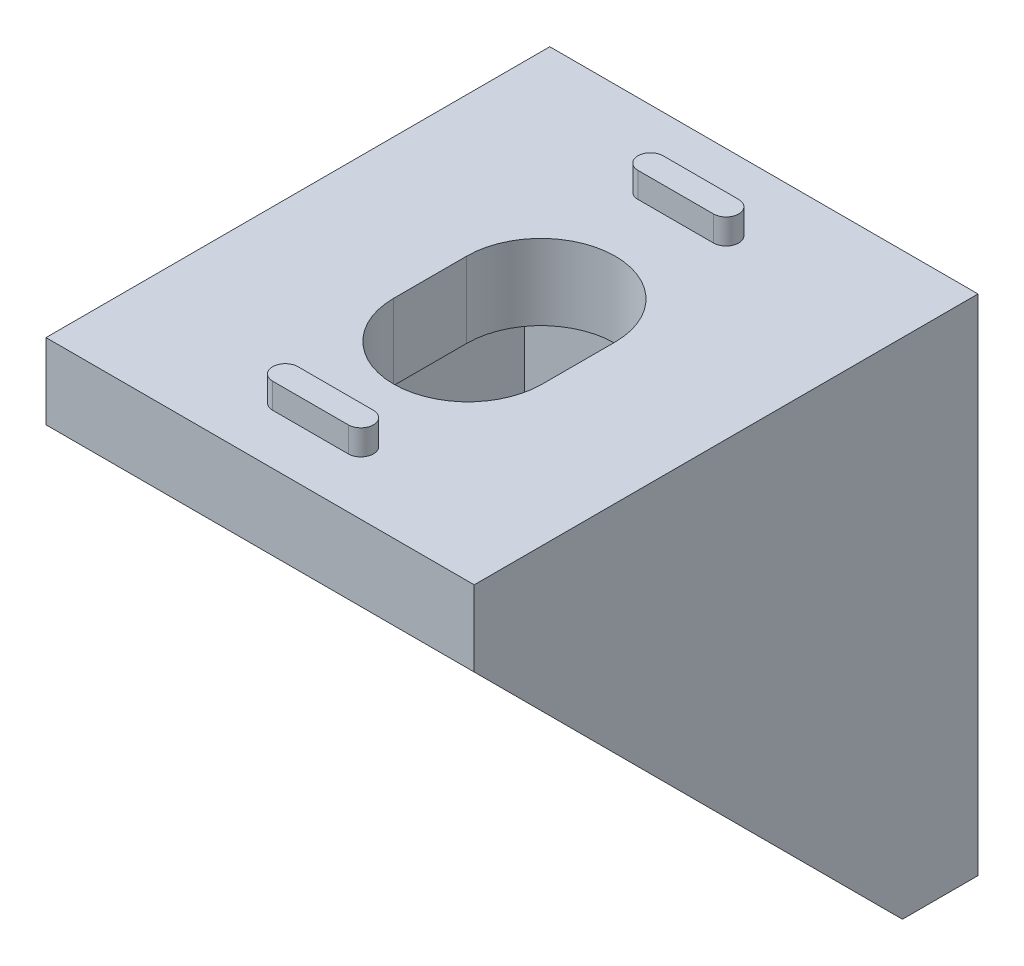
ISO-10303-21;
HEADER;
FILE_DESCRIPTION(('STEP AP214'),'2;1');
FILE_NAME('part.step','',(''),(''),'','','');
FILE_SCHEMA(('AUTOMOTIVE_DESIGN { 1 0 10303 214 1 1 1 1 }'));
ENDSEC;
DATA;
#1=APPLICATION_CONTEXT('core data for automotive mechanical design processes');
#2=APPLICATION_PROTOCOL_DEFINITION('international standard','automotive_design',2000,#1);
#3=PRODUCT_CONTEXT('',#1,'mechanical');
#4=PRODUCT('Part','Part','',(#3));
#5=PRODUCT_RELATED_PRODUCT_CATEGORY('part','',(#4));
#6=PRODUCT_DEFINITION_FORMATION('','',#4);
#7=PRODUCT_DEFINITION_CONTEXT('part definition',#1,'design');
#8=PRODUCT_DEFINITION('design','',#6,#7);
#9=PRODUCT_DEFINITION_SHAPE('','',#8);
#10=(LENGTH_UNIT() NAMED_UNIT(*) SI_UNIT(.MILLI.,.METRE.));
#11=(NAMED_UNIT(*) PLANE_ANGLE_UNIT() SI_UNIT($,.RADIAN.));
#12=(NAMED_UNIT(*) SI_UNIT($,.STERADIAN.) SOLID_ANGLE_UNIT());
#13=UNCERTAINTY_MEASURE_WITH_UNIT(LENGTH_MEASURE(1.E-05),#10,'distance_accuracy_value','');
#14=(GEOMETRIC_REPRESENTATION_CONTEXT(3) GLOBAL_UNCERTAINTY_ASSIGNED_CONTEXT((#13)) GLOBAL_UNIT_ASSIGNED_CONTEXT((#10,
#11,#12)) REPRESENTATION_CONTEXT('',''));
#15=CARTESIAN_POINT('',(0.,0.,0.));
#16=DIRECTION('',(0.,0.,1.));
#17=DIRECTION('',(1.,0.,0.));
#18=AXIS2_PLACEMENT_3D('',#15,#16,#17);
#19=CARTESIAN_POINT('',(0.,0.,0.));
#20=DIRECTION('',(0.,0.,-1.));
#21=DIRECTION('',(-1.,0.,0.));
#22=AXIS2_PLACEMENT_3D('',#19,#20,#21);
#23=PLANE('',#22);
#24=CARTESIAN_POINT('',(0.,1.15,0.));
#25=DIRECTION('',(0.,0.,-1.));
#26=DIRECTION('',(-1.,0.,0.));
#27=AXIS2_PLACEMENT_3D('',#24,#25,#26);
#28=CIRCLE('',#27,2.95);
#29=CARTESIAN_POINT('',(-2.95,1.15,0.));
#30=VERTEX_POINT('',#29);
#31=CARTESIAN_POINT('',(2.95,1.15,0.));
#32=VERTEX_POINT('',#31);
#33=EDGE_CURVE('E280',#30,#32,#28,.T.);
#34=ORIENTED_EDGE('',*,*,#33,.F.);
#35=DIRECTION('',(0.,1.,0.));
#36=VECTOR('',#35,1.);
#37=CARTESIAN_POINT('',(-2.95,1.15,0.));
#38=LINE('',#37,#36);
#39=CARTESIAN_POINT('',(-2.95,-1.75,0.));
#40=VERTEX_POINT('',#39);
#41=EDGE_CURVE('E295',#40,#30,#38,.T.);
#42=ORIENTED_EDGE('',*,*,#41,.F.);
#43=CARTESIAN_POINT('',(0.,-1.75,0.));
#44=DIRECTION('',(0.,0.,-1.));
#45=DIRECTION('',(-1.,0.,0.));
#46=AXIS2_PLACEMENT_3D('',#43,#44,#45);
#47=CIRCLE('',#46,2.95);
#48=CARTESIAN_POINT('',(2.95,-1.75,0.));
#49=VERTEX_POINT('',#48);
#50=EDGE_CURVE('E291',#49,#40,#47,.T.);
#51=ORIENTED_EDGE('',*,*,#50,.F.);
#52=DIRECTION('',(0.,-1.,0.));
#53=VECTOR('',#52,1.);
#54=CARTESIAN_POINT('',(2.95,1.15,0.));
#55=LINE('',#54,#53);
#56=EDGE_CURVE('E287',#32,#49,#55,.T.);
#57=ORIENTED_EDGE('',*,*,#56,.F.);
#58=EDGE_LOOP('',(#34,#42,#51,#57));
#59=FACE_BOUND('',#58,.T.);
#60=DIRECTION('',(0.,1.,0.));
#61=VECTOR('',#60,1.);
#62=CARTESIAN_POINT('',(8.5,-10.,0.));
#63=LINE('',#62,#61);
#64=CARTESIAN_POINT('',(8.5,-10.,0.));
#65=VERTEX_POINT('',#64);
#66=CARTESIAN_POINT('',(8.5,10.,0.));
#67=VERTEX_POINT('',#66);
#68=EDGE_CURVE('E539',#65,#67,#63,.T.);
#69=ORIENTED_EDGE('',*,*,#68,.F.);
#70=DIRECTION('',(1.,0.,0.));
#71=VECTOR('',#70,1.);
#72=CARTESIAN_POINT('',(-8.5,-10.,0.));
#73=LINE('',#72,#71);
#74=CARTESIAN_POINT('',(-8.5,-10.,0.));
#75=VERTEX_POINT('',#74);
#76=EDGE_CURVE('E557',#75,#65,#73,.T.);
#77=ORIENTED_EDGE('',*,*,#76,.F.);
#78=DIRECTION('',(0.,-1.,0.));
#79=VECTOR('',#78,1.);
#80=CARTESIAN_POINT('',(-8.5,-10.,0.));
#81=LINE('',#80,#79);
#82=CARTESIAN_POINT('',(-8.5,10.,0.));
#83=VERTEX_POINT('',#82);
#84=EDGE_CURVE('E554',#83,#75,#81,.T.);
#85=ORIENTED_EDGE('',*,*,#84,.F.);
#86=DIRECTION('',(-1.,0.,0.));
#87=VECTOR('',#86,1.);
#88=CARTESIAN_POINT('',(-8.5,10.,0.));
#89=LINE('',#88,#87);
#90=EDGE_CURVE('E551',#67,#83,#89,.T.);
#91=ORIENTED_EDGE('',*,*,#90,.F.);
#92=EDGE_LOOP('',(#69,#77,#85,#91));
#93=FACE_BOUND('',#92,.T.);
#94=DIRECTION('',(-1.,0.,0.));
#95=VECTOR('',#94,1.);
#96=CARTESIAN_POINT('',(1.5,6.5,0.));
#97=LINE('',#96,#95);
#98=CARTESIAN_POINT('',(1.5,6.5,0.));
#99=VERTEX_POINT('',#98);
#100=CARTESIAN_POINT('',(-1.5,6.5,0.));
#101=VERTEX_POINT('',#100);
#102=EDGE_CURVE('E372',#99,#101,#97,.T.);
#103=ORIENTED_EDGE('',*,*,#102,.F.);
#104=CARTESIAN_POINT('',(1.5,7.,0.));
#105=DIRECTION('',(0.,0.,-1.));
#106=DIRECTION('',(-1.,0.,0.));
#107=AXIS2_PLACEMENT_3D('',#104,#105,#106);
#108=CIRCLE('',#107,0.5);
#109=CARTESIAN_POINT('',(1.5,7.5,0.));
#110=VERTEX_POINT('',#109);
#111=EDGE_CURVE('E353',#110,#99,#108,.T.);
#112=ORIENTED_EDGE('',*,*,#111,.F.);
#113=DIRECTION('',(1.,0.,0.));
#114=VECTOR('',#113,1.);
#115=CARTESIAN_POINT('',(1.5,7.5,0.));
#116=LINE('',#115,#114);
#117=CARTESIAN_POINT('',(-1.5,7.5,0.));
#118=VERTEX_POINT('',#117);
#119=EDGE_CURVE('E359',#118,#110,#116,.T.);
#120=ORIENTED_EDGE('',*,*,#119,.F.);
#121=CARTESIAN_POINT('',(-1.5,7.,0.));
#122=DIRECTION('',(0.,0.,-1.));
#123=DIRECTION('',(-1.,0.,0.));
#124=AXIS2_PLACEMENT_3D('',#121,#122,#123);
#125=CIRCLE('',#124,0.5);
#126=EDGE_CURVE('E375',#101,#118,#125,.T.);
#127=ORIENTED_EDGE('',*,*,#126,.F.);
#128=EDGE_LOOP('',(#103,#112,#120,#127));
#129=FACE_BOUND('',#128,.T.);
#130=DIRECTION('',(-1.,0.,0.));
#131=VECTOR('',#130,1.);
#132=CARTESIAN_POINT('',(1.5,-8.,0.));
#133=LINE('',#132,#131);
#134=CARTESIAN_POINT('',(1.5,-8.,0.));
#135=VERTEX_POINT('',#134);
#136=CARTESIAN_POINT('',(-1.5,-8.,0.));
#137=VERTEX_POINT('',#136);
#138=EDGE_CURVE('E331',#135,#137,#133,.T.);
#139=ORIENTED_EDGE('',*,*,#138,.F.);
#140=CARTESIAN_POINT('',(1.5,-7.5,0.));
#141=DIRECTION('',(0.,0.,-1.));
#142=DIRECTION('',(-1.,0.,0.));
#143=AXIS2_PLACEMENT_3D('',#140,#141,#142);
#144=CIRCLE('',#143,0.5);
#145=CARTESIAN_POINT('',(1.5,-7.,0.));
#146=VERTEX_POINT('',#145);
#147=EDGE_CURVE('E303',#146,#135,#144,.T.);
#148=ORIENTED_EDGE('',*,*,#147,.F.);
#149=DIRECTION('',(1.,0.,0.));
#150=VECTOR('',#149,1.);
#151=CARTESIAN_POINT('',(1.5,-7.,0.));
#152=LINE('',#151,#150);
#153=CARTESIAN_POINT('',(-1.5,-7.,0.));
#154=VERTEX_POINT('',#153);
#155=EDGE_CURVE('E318',#154,#146,#152,.T.);
#156=ORIENTED_EDGE('',*,*,#155,.F.);
#157=CARTESIAN_POINT('',(-1.5,-7.5,0.));
#158=DIRECTION('',(0.,0.,-1.));
#159=DIRECTION('',(-1.,0.,0.));
#160=AXIS2_PLACEMENT_3D('',#157,#158,#159);
#161=CIRCLE('',#160,0.5);
#162=EDGE_CURVE('E334',#137,#154,#161,.T.);
#163=ORIENTED_EDGE('',*,*,#162,.F.);
#164=EDGE_LOOP('',(#139,#148,#156,#163));
#165=FACE_BOUND('',#164,.T.);
#166=ADVANCED_FACE('F39',(#59,#93,#129,#165),#23,.T.);
#167=CARTESIAN_POINT('',(-8.5,10.,3.));
#168=DIRECTION('',(0.,-1.,0.));
#169=DIRECTION('',(0.,0.,-1.));
#170=AXIS2_PLACEMENT_3D('',#167,#168,#169);
#171=PLANE('',#170);
#172=DIRECTION('',(0.,0.,1.));
#173=VECTOR('',#172,1.);
#174=CARTESIAN_POINT('',(-2.95,10.,8.85));
#175=LINE('',#174,#173);
#176=CARTESIAN_POINT('',(-2.95,10.,8.85));
#177=VERTEX_POINT('',#176);
#178=CARTESIAN_POINT('',(-2.95,10.,11.75));
#179=VERTEX_POINT('',#178);
#180=EDGE_CURVE('E262',#177,#179,#175,.T.);
#181=ORIENTED_EDGE('',*,*,#180,.F.);
#182=CARTESIAN_POINT('',(0.,10.,8.85));
#183=DIRECTION('',(0.,1.,0.));
#184=DIRECTION('',(0.,0.,1.));
#185=AXIS2_PLACEMENT_3D('',#182,#183,#184);
#186=CIRCLE('',#185,2.95);
#187=CARTESIAN_POINT('',(2.95,10.,8.85));
#188=VERTEX_POINT('',#187);
#189=EDGE_CURVE('E55',#188,#177,#186,.T.);
#190=ORIENTED_EDGE('',*,*,#189,.F.);
#191=DIRECTION('',(0.,0.,-1.));
#192=VECTOR('',#191,1.);
#193=CARTESIAN_POINT('',(2.95,10.,8.85));
#194=LINE('',#193,#192);
#195=CARTESIAN_POINT('',(2.95,10.,11.75));
#196=VERTEX_POINT('',#195);
#197=EDGE_CURVE('E270',#196,#188,#194,.T.);
#198=ORIENTED_EDGE('',*,*,#197,.F.);
#199=CARTESIAN_POINT('',(0.,10.,11.75));
#200=DIRECTION('',(0.,1.,0.));
#201=DIRECTION('',(0.,0.,1.));
#202=AXIS2_PLACEMENT_3D('',#199,#200,#201);
#203=CIRCLE('',#202,2.95);
#204=EDGE_CURVE('E252',#179,#196,#203,.T.);
#205=ORIENTED_EDGE('',*,*,#204,.F.);
#206=EDGE_LOOP('',(#181,#190,#198,#205));
#207=FACE_BOUND('',#206,.T.);
#208=CARTESIAN_POINT('',(-1.5,10.,3.));
#209=DIRECTION('',(0.,1.,0.));
#210=DIRECTION('',(0.,0.,1.));
#211=AXIS2_PLACEMENT_3D('',#208,#209,#210);
#212=CIRCLE('',#211,0.5);
#213=CARTESIAN_POINT('',(-1.5,10.,2.5));
#214=VERTEX_POINT('',#213);
#215=CARTESIAN_POINT('',(-1.5,10.,3.5));
#216=VERTEX_POINT('',#215);
#217=EDGE_CURVE('E439',#214,#216,#212,.T.);
#218=ORIENTED_EDGE('',*,*,#217,.F.);
#219=DIRECTION('',(-1.,0.,0.));
#220=VECTOR('',#219,1.);
#221=CARTESIAN_POINT('',(-1.5,10.,2.5));
#222=LINE('',#221,#220);
#223=CARTESIAN_POINT('',(1.5,10.,2.5));
#224=VERTEX_POINT('',#223);
#225=EDGE_CURVE('E445',#224,#214,#222,.T.);
#226=ORIENTED_EDGE('',*,*,#225,.F.);
#227=CARTESIAN_POINT('',(1.5,10.,3.));
#228=DIRECTION('',(0.,1.,0.));
#229=DIRECTION('',(0.,0.,1.));
#230=AXIS2_PLACEMENT_3D('',#227,#228,#229);
#231=CIRCLE('',#230,0.5);
#232=CARTESIAN_POINT('',(1.5,10.,3.5));
#233=VERTEX_POINT('',#232);
#234=EDGE_CURVE('E462',#233,#224,#231,.T.);
#235=ORIENTED_EDGE('',*,*,#234,.F.);
#236=DIRECTION('',(1.,0.,0.));
#237=VECTOR('',#236,1.);
#238=CARTESIAN_POINT('',(-1.5,10.,3.5));
#239=LINE('',#238,#237);
#240=EDGE_CURVE('E458',#216,#233,#239,.T.);
#241=ORIENTED_EDGE('',*,*,#240,.F.);
#242=EDGE_LOOP('',(#218,#226,#235,#241));
#243=FACE_BOUND('',#242,.T.);
#244=ORIENTED_EDGE('',*,*,#90,.T.);
#245=DIRECTION('',(0.,0.,-1.));
#246=VECTOR('',#245,1.);
#247=CARTESIAN_POINT('',(-8.5,10.,3.));
#248=LINE('',#247,#246);
#249=CARTESIAN_POINT('',(-8.5,10.,20.));
#250=VERTEX_POINT('',#249);
#251=EDGE_CURVE('E567',#250,#83,#248,.T.);
#252=ORIENTED_EDGE('',*,*,#251,.F.);
#253=DIRECTION('',(-1.,0.,0.));
#254=VECTOR('',#253,1.);
#255=CARTESIAN_POINT('',(-8.5,10.,20.));
#256=LINE('',#255,#254);
#257=CARTESIAN_POINT('',(8.5,10.,20.));
#258=VERTEX_POINT('',#257);
#259=EDGE_CURVE('E535',#258,#250,#256,.T.);
#260=ORIENTED_EDGE('',*,*,#259,.F.);
#261=DIRECTION('',(0.,0.,-1.));
#262=VECTOR('',#261,1.);
#263=CARTESIAN_POINT('',(8.5,10.,3.));
#264=LINE('',#263,#262);
#265=EDGE_CURVE('E571',#258,#67,#264,.T.);
#266=ORIENTED_EDGE('',*,*,#265,.T.);
#267=EDGE_LOOP('',(#244,#252,#260,#266));
#268=FACE_BOUND('',#267,.T.);
#269=CARTESIAN_POINT('',(-1.49999999999999,10.,17.5));
#270=DIRECTION('',(0.,1.,0.));
#271=DIRECTION('',(0.,0.,1.));
#272=AXIS2_PLACEMENT_3D('',#269,#270,#271);
#273=CIRCLE('',#272,0.500000000000004);
#274=CARTESIAN_POINT('',(-1.49999999999999,10.,17.));
#275=VERTEX_POINT('',#274);
#276=CARTESIAN_POINT('',(-1.49999999999999,10.,18.));
#277=VERTEX_POINT('',#276);
#278=EDGE_CURVE('E394',#275,#277,#273,.T.);
#279=ORIENTED_EDGE('',*,*,#278,.F.);
#280=DIRECTION('',(-1.,0.,0.));
#281=VECTOR('',#280,1.);
#282=CARTESIAN_POINT('',(-1.49999999999999,10.,17.));
#283=LINE('',#282,#281);
#284=CARTESIAN_POINT('',(1.5,10.,17.));
#285=VERTEX_POINT('',#284);
#286=EDGE_CURVE('E400',#285,#275,#283,.T.);
#287=ORIENTED_EDGE('',*,*,#286,.F.);
#288=CARTESIAN_POINT('',(1.50000000000001,10.,17.5));
#289=DIRECTION('',(0.,1.,0.));
#290=DIRECTION('',(0.,0.,1.));
#291=AXIS2_PLACEMENT_3D('',#288,#289,#290);
#292=CIRCLE('',#291,0.5);
#293=CARTESIAN_POINT('',(1.50000000000001,10.,18.));
#294=VERTEX_POINT('',#293);
#295=EDGE_CURVE('E417',#294,#285,#292,.T.);
#296=ORIENTED_EDGE('',*,*,#295,.F.);
#297=DIRECTION('',(1.,0.,0.));
#298=VECTOR('',#297,1.);
#299=CARTESIAN_POINT('',(-1.49999999999999,10.,18.));
#300=LINE('',#299,#298);
#301=EDGE_CURVE('E413',#277,#294,#300,.T.);
#302=ORIENTED_EDGE('',*,*,#301,.F.);
#303=EDGE_LOOP('',(#279,#287,#296,#302));
#304=FACE_BOUND('',#303,.T.);
#305=ADVANCED_FACE('F267',(#207,#243,#268,#304),#171,.F.);
#306=CARTESIAN_POINT('',(0.,0.,3.));
#307=DIRECTION('',(0.,0.,-1.));
#308=DIRECTION('',(-1.,0.,0.));
#309=AXIS2_PLACEMENT_3D('',#306,#307,#308);
#310=PLANE('',#309);
#311=DIRECTION('',(0.,1.,0.));
#312=VECTOR('',#311,1.);
#313=CARTESIAN_POINT('',(-2.95,0.,3.));
#314=LINE('',#313,#312);
#315=CARTESIAN_POINT('',(-2.95,-1.75,3.));
#316=VERTEX_POINT('',#315);
#317=CARTESIAN_POINT('',(-2.95,1.15,3.));
#318=VERTEX_POINT('',#317);
#319=EDGE_CURVE('E583',#316,#318,#314,.T.);
#320=ORIENTED_EDGE('',*,*,#319,.T.);
#321=CARTESIAN_POINT('',(0.,1.15,3.));
#322=DIRECTION('',(0.,0.,-1.));
#323=DIRECTION('',(-1.,0.,0.));
#324=AXIS2_PLACEMENT_3D('',#321,#322,#323);
#325=CIRCLE('',#324,2.95);
#326=CARTESIAN_POINT('',(2.95,1.15,3.));
#327=VERTEX_POINT('',#326);
#328=EDGE_CURVE('E587',#318,#327,#325,.T.);
#329=ORIENTED_EDGE('',*,*,#328,.T.);
#330=DIRECTION('',(0.,-1.,0.));
#331=VECTOR('',#330,1.);
#332=CARTESIAN_POINT('',(2.95,0.,3.));
#333=LINE('',#332,#331);
#334=CARTESIAN_POINT('',(2.95,-1.75,3.));
#335=VERTEX_POINT('',#334);
#336=EDGE_CURVE('E575',#327,#335,#333,.T.);
#337=ORIENTED_EDGE('',*,*,#336,.T.);
#338=CARTESIAN_POINT('',(0.,-1.75,3.));
#339=DIRECTION('',(0.,0.,-1.));
#340=DIRECTION('',(-1.,0.,0.));
#341=AXIS2_PLACEMENT_3D('',#338,#339,#340);
#342=CIRCLE('',#341,2.95);
#343=EDGE_CURVE('E579',#335,#316,#342,.T.);
#344=ORIENTED_EDGE('',*,*,#343,.T.);
#345=EDGE_LOOP('',(#320,#329,#337,#344));
#346=FACE_BOUND('',#345,.T.);
#347=DIRECTION('',(1.,0.,0.));
#348=VECTOR('',#347,1.);
#349=CARTESIAN_POINT('',(-8.5,-10.,3.));
#350=LINE('',#349,#348);
#351=CARTESIAN_POINT('',(-6.5,-10.,3.));
#352=VERTEX_POINT('',#351);
#353=CARTESIAN_POINT('',(6.5,-10.,3.));
#354=VERTEX_POINT('',#353);
#355=EDGE_CURVE('E547',#352,#354,#350,.T.);
#356=ORIENTED_EDGE('',*,*,#355,.T.);
#357=DIRECTION('',(0.,1.,0.));
#358=VECTOR('',#357,1.);
#359=CARTESIAN_POINT('',(6.5,-10.,3.));
#360=LINE('',#359,#358);
#361=CARTESIAN_POINT('',(6.5,7.,3.));
#362=VERTEX_POINT('',#361);
#363=EDGE_CURVE('E492',#354,#362,#360,.T.);
#364=ORIENTED_EDGE('',*,*,#363,.T.);
#365=DIRECTION('',(1.,0.,0.));
#366=VECTOR('',#365,1.);
#367=CARTESIAN_POINT('',(-8.5,7.,3.));
#368=LINE('',#367,#366);
#369=CARTESIAN_POINT('',(-6.5,7.,3.));
#370=VERTEX_POINT('',#369);
#371=EDGE_CURVE('E518',#370,#362,#368,.T.);
#372=ORIENTED_EDGE('',*,*,#371,.F.);
#373=DIRECTION('',(0.,-1.,0.));
#374=VECTOR('',#373,1.);
#375=CARTESIAN_POINT('',(-6.5,-10.,3.));
#376=LINE('',#375,#374);
#377=EDGE_CURVE('E511',#370,#352,#376,.T.);
#378=ORIENTED_EDGE('',*,*,#377,.T.);
#379=EDGE_LOOP('',(#356,#364,#372,#378));
#380=FACE_BOUND('',#379,.T.);
#381=ADVANCED_FACE('F623',(#346,#380),#310,.F.);
#382=CARTESIAN_POINT('',(-8.5,7.,20.));
#383=DIRECTION('',(0.,1.,0.));
#384=DIRECTION('',(-1.,0.,0.));
#385=AXIS2_PLACEMENT_3D('',#382,#383,#384);
#386=PLANE('',#385);
#387=DIRECTION('',(0.,0.,-1.));
#388=VECTOR('',#387,1.);
#389=CARTESIAN_POINT('',(2.95000000000001,7.,20.));
#390=LINE('',#389,#388);
#391=CARTESIAN_POINT('',(2.95,7.,11.75));
#392=VERTEX_POINT('',#391);
#393=CARTESIAN_POINT('',(2.95,7.,8.85));
#394=VERTEX_POINT('',#393);
#395=EDGE_CURVE('E48',#392,#394,#390,.T.);
#396=ORIENTED_EDGE('',*,*,#395,.T.);
#397=CARTESIAN_POINT('',(0.,7.,8.85));
#398=DIRECTION('',(0.,1.,0.));
#399=DIRECTION('',(-1.,0.,0.));
#400=AXIS2_PLACEMENT_3D('',#397,#398,#399);
#401=CIRCLE('',#400,2.95);
#402=CARTESIAN_POINT('',(-2.95,7.,8.85));
#403=VERTEX_POINT('',#402);
#404=EDGE_CURVE('E11',#394,#403,#401,.T.);
#405=ORIENTED_EDGE('',*,*,#404,.T.);
#406=DIRECTION('',(0.,0.,1.));
#407=VECTOR('',#406,1.);
#408=CARTESIAN_POINT('',(-2.95,7.,20.));
#409=LINE('',#408,#407);
#410=CARTESIAN_POINT('',(-2.95,7.,11.75));
#411=VERTEX_POINT('',#410);
#412=EDGE_CURVE('E591',#403,#411,#409,.T.);
#413=ORIENTED_EDGE('',*,*,#412,.T.);
#414=CARTESIAN_POINT('',(0.,7.,11.75));
#415=DIRECTION('',(0.,1.,0.));
#416=DIRECTION('',(-1.,0.,0.));
#417=AXIS2_PLACEMENT_3D('',#414,#415,#416);
#418=CIRCLE('',#417,2.95);
#419=EDGE_CURVE('E255',#411,#392,#418,.T.);
#420=ORIENTED_EDGE('',*,*,#419,.T.);
#421=EDGE_LOOP('',(#396,#405,#413,#420));
#422=FACE_BOUND('',#421,.T.);
#423=ORIENTED_EDGE('',*,*,#371,.T.);
#424=DIRECTION('',(0.,0.,1.));
#425=VECTOR('',#424,1.);
#426=CARTESIAN_POINT('',(6.5,7.,3.));
#427=LINE('',#426,#425);
#428=CARTESIAN_POINT('',(6.5,7.,20.));
#429=VERTEX_POINT('',#428);
#430=EDGE_CURVE('E485',#362,#429,#427,.T.);
#431=ORIENTED_EDGE('',*,*,#430,.T.);
#432=DIRECTION('',(1.,0.,0.));
#433=VECTOR('',#432,1.);
#434=CARTESIAN_POINT('',(-8.5,7.,20.));
#435=LINE('',#434,#433);
#436=CARTESIAN_POINT('',(-6.5,7.,20.));
#437=VERTEX_POINT('',#436);
#438=EDGE_CURVE('E526',#437,#429,#435,.T.);
#439=ORIENTED_EDGE('',*,*,#438,.F.);
#440=DIRECTION('',(0.,0.,-1.));
#441=VECTOR('',#440,1.);
#442=CARTESIAN_POINT('',(-6.5,7.,3.));
#443=LINE('',#442,#441);
#444=EDGE_CURVE('E507',#437,#370,#443,.T.);
#445=ORIENTED_EDGE('',*,*,#444,.T.);
#446=EDGE_LOOP('',(#423,#431,#439,#445));
#447=FACE_BOUND('',#446,.T.);
#448=ADVANCED_FACE('F598',(#422,#447),#386,.F.);
#449=CARTESIAN_POINT('',(8.5,-10.,3.));
#450=DIRECTION('',(-1.,0.,0.));
#451=DIRECTION('',(0.,0.,1.));
#452=AXIS2_PLACEMENT_3D('',#449,#450,#451);
#453=PLANE('',#452);
#454=ORIENTED_EDGE('',*,*,#68,.T.);
#455=ORIENTED_EDGE('',*,*,#265,.F.);
#456=DIRECTION('',(0.,1.,0.));
#457=VECTOR('',#456,1.);
#458=CARTESIAN_POINT('',(8.5,10.,20.));
#459=LINE('',#458,#457);
#460=CARTESIAN_POINT('',(8.5,7.,20.));
#461=VERTEX_POINT('',#460);
#462=EDGE_CURVE('E531',#461,#258,#459,.T.);
#463=ORIENTED_EDGE('',*,*,#462,.F.);
#464=DIRECTION('',(0.,-0.707106781186547,-0.707106781186548));
#465=VECTOR('',#464,1.);
#466=CARTESIAN_POINT('',(8.5,7.,20.));
#467=LINE('',#466,#465);
#468=CARTESIAN_POINT('',(8.5,-10.,3.));
#469=VERTEX_POINT('',#468);
#470=EDGE_CURVE('E484',#461,#469,#467,.T.);
#471=ORIENTED_EDGE('',*,*,#470,.T.);
#472=DIRECTION('',(0.,0.,-1.));
#473=VECTOR('',#472,1.);
#474=CARTESIAN_POINT('',(8.5,-10.,3.));
#475=LINE('',#474,#473);
#476=EDGE_CURVE('E546',#469,#65,#475,.T.);
#477=ORIENTED_EDGE('',*,*,#476,.T.);
#478=EDGE_LOOP('',(#454,#455,#463,#471,#477));
#479=FACE_BOUND('',#478,.T.);
#480=ADVANCED_FACE('F41',(#479),#453,.F.);
#481=CARTESIAN_POINT('',(-8.5,-10.,3.));
#482=DIRECTION('',(1.,0.,0.));
#483=DIRECTION('',(0.,0.,-1.));
#484=AXIS2_PLACEMENT_3D('',#481,#482,#483);
#485=PLANE('',#484);
#486=DIRECTION('',(0.,0.,-1.));
#487=VECTOR('',#486,1.);
#488=CARTESIAN_POINT('',(-8.5,-10.,3.));
#489=LINE('',#488,#487);
#490=CARTESIAN_POINT('',(-8.5,-10.,3.));
#491=VERTEX_POINT('',#490);
#492=EDGE_CURVE('E563',#491,#75,#489,.T.);
#493=ORIENTED_EDGE('',*,*,#492,.F.);
#494=DIRECTION('',(0.,0.707106781186547,0.707106781186548));
#495=VECTOR('',#494,1.);
#496=CARTESIAN_POINT('',(-8.5,7.,20.));
#497=LINE('',#496,#495);
#498=CARTESIAN_POINT('',(-8.5,7.,20.));
#499=VERTEX_POINT('',#498);
#500=EDGE_CURVE('E503',#491,#499,#497,.T.);
#501=ORIENTED_EDGE('',*,*,#500,.T.);
#502=DIRECTION('',(0.,-1.,0.));
#503=VECTOR('',#502,1.);
#504=CARTESIAN_POINT('',(-8.5,10.,20.));
#505=LINE('',#504,#503);
#506=EDGE_CURVE('E522',#250,#499,#505,.T.);
#507=ORIENTED_EDGE('',*,*,#506,.F.);
#508=ORIENTED_EDGE('',*,*,#251,.T.);
#509=ORIENTED_EDGE('',*,*,#84,.T.);
#510=EDGE_LOOP('',(#493,#501,#507,#508,#509));
#511=FACE_BOUND('',#510,.T.);
#512=ADVANCED_FACE('F633',(#511),#485,.F.);
#513=CARTESIAN_POINT('',(-8.5,-10.,3.));
#514=DIRECTION('',(0.,1.,0.));
#515=DIRECTION('',(0.,0.,1.));
#516=AXIS2_PLACEMENT_3D('',#513,#514,#515);
#517=PLANE('',#516);
#518=ORIENTED_EDGE('',*,*,#76,.T.);
#519=ORIENTED_EDGE('',*,*,#476,.F.);
#520=DIRECTION('',(1.,0.,0.));
#521=VECTOR('',#520,1.);
#522=CARTESIAN_POINT('',(6.5,-10.,3.));
#523=LINE('',#522,#521);
#524=EDGE_CURVE('E500',#354,#469,#523,.T.);
#525=ORIENTED_EDGE('',*,*,#524,.F.);
#526=ORIENTED_EDGE('',*,*,#355,.F.);
#527=EDGE_CURVE('E543',#491,#352,#350,.T.);
#528=ORIENTED_EDGE('',*,*,#527,.F.);
#529=ORIENTED_EDGE('',*,*,#492,.T.);
#530=EDGE_LOOP('',(#518,#519,#525,#526,#528,#529));
#531=FACE_BOUND('',#530,.T.);
#532=ADVANCED_FACE('F629',(#531),#517,.F.);
#533=CARTESIAN_POINT('',(0.,0.,20.));
#534=DIRECTION('',(0.,0.,1.));
#535=DIRECTION('',(1.,0.,0.));
#536=AXIS2_PLACEMENT_3D('',#533,#534,#535);
#537=PLANE('',#536);
#538=ORIENTED_EDGE('',*,*,#506,.T.);
#539=EDGE_CURVE('E527',#499,#437,#435,.T.);
#540=ORIENTED_EDGE('',*,*,#539,.T.);
#541=ORIENTED_EDGE('',*,*,#438,.T.);
#542=DIRECTION('',(1.,0.,0.));
#543=VECTOR('',#542,1.);
#544=CARTESIAN_POINT('',(6.5,7.,20.));
#545=LINE('',#544,#543);
#546=EDGE_CURVE('E496',#429,#461,#545,.T.);
#547=ORIENTED_EDGE('',*,*,#546,.T.);
#548=ORIENTED_EDGE('',*,*,#462,.T.);
#549=ORIENTED_EDGE('',*,*,#259,.T.);
#550=EDGE_LOOP('',(#538,#540,#541,#547,#548,#549));
#551=FACE_BOUND('',#550,.T.);
#552=ADVANCED_FACE('F632',(#551),#537,.T.);
#553=CARTESIAN_POINT('',(-6.5,7.,20.));
#554=DIRECTION('',(0.,-0.707106781186548,0.707106781186547));
#555=DIRECTION('',(0.,-0.707106781186547,-0.707106781186548));
#556=AXIS2_PLACEMENT_3D('',#553,#554,#555);
#557=PLANE('',#556);
#558=ORIENTED_EDGE('',*,*,#500,.F.);
#559=ORIENTED_EDGE('',*,*,#527,.T.);
#560=DIRECTION('',(0.,0.707106781186547,0.707106781186548));
#561=VECTOR('',#560,1.);
#562=CARTESIAN_POINT('',(-6.5,7.,20.));
#563=LINE('',#562,#561);
#564=EDGE_CURVE('E515',#352,#437,#563,.T.);
#565=ORIENTED_EDGE('',*,*,#564,.T.);
#566=ORIENTED_EDGE('',*,*,#539,.F.);
#567=EDGE_LOOP('',(#558,#559,#565,#566));
#568=FACE_BOUND('',#567,.T.);
#569=ADVANCED_FACE('F651',(#568),#557,.T.);
#570=CARTESIAN_POINT('',(-6.5,0.,0.));
#571=DIRECTION('',(-1.,0.,0.));
#572=DIRECTION('',(0.,0.,1.));
#573=AXIS2_PLACEMENT_3D('',#570,#571,#572);
#574=PLANE('',#573);
#575=ORIENTED_EDGE('',*,*,#444,.F.);
#576=ORIENTED_EDGE('',*,*,#564,.F.);
#577=ORIENTED_EDGE('',*,*,#377,.F.);
#578=EDGE_LOOP('',(#575,#576,#577));
#579=FACE_BOUND('',#578,.T.);
#580=ADVANCED_FACE('F654',(#579),#574,.F.);
#581=CARTESIAN_POINT('',(6.5,7.,20.));
#582=DIRECTION('',(0.,-0.707106781186548,0.707106781186547));
#583=DIRECTION('',(0.,-0.707106781186547,-0.707106781186548));
#584=AXIS2_PLACEMENT_3D('',#581,#582,#583);
#585=PLANE('',#584);
#586=ORIENTED_EDGE('',*,*,#470,.F.);
#587=ORIENTED_EDGE('',*,*,#546,.F.);
#588=DIRECTION('',(0.,-0.707106781186547,-0.707106781186548));
#589=VECTOR('',#588,1.);
#590=CARTESIAN_POINT('',(6.5,7.,20.));
#591=LINE('',#590,#589);
#592=EDGE_CURVE('E489',#429,#354,#591,.T.);
#593=ORIENTED_EDGE('',*,*,#592,.T.);
#594=ORIENTED_EDGE('',*,*,#524,.T.);
#595=EDGE_LOOP('',(#586,#587,#593,#594));
#596=FACE_BOUND('',#595,.T.);
#597=ADVANCED_FACE('F669',(#596),#585,.T.);
#598=CARTESIAN_POINT('',(6.5,0.,0.));
#599=DIRECTION('',(-1.,0.,0.));
#600=DIRECTION('',(0.,0.,1.));
#601=AXIS2_PLACEMENT_3D('',#598,#599,#600);
#602=PLANE('',#601);
#603=ORIENTED_EDGE('',*,*,#430,.F.);
#604=ORIENTED_EDGE('',*,*,#363,.F.);
#605=ORIENTED_EDGE('',*,*,#592,.F.);
#606=EDGE_LOOP('',(#603,#604,#605));
#607=FACE_BOUND('',#606,.T.);
#608=ADVANCED_FACE('F718',(#607),#602,.T.);
#609=CARTESIAN_POINT('',(-1.5,11.,3.));
#610=DIRECTION('',(0.,-1.,0.));
#611=DIRECTION('',(0.,0.,-1.));
#612=AXIS2_PLACEMENT_3D('',#609,#610,#611);
#613=CYLINDRICAL_SURFACE('',#612,0.5);
#614=ORIENTED_EDGE('',*,*,#217,.T.);
#615=DIRECTION('',(0.,-1.,0.));
#616=VECTOR('',#615,1.);
#617=CARTESIAN_POINT('',(-1.5,11.,3.5));
#618=LINE('',#617,#616);
#619=CARTESIAN_POINT('',(-1.5,11.,3.5));
#620=VERTEX_POINT('',#619);
#621=EDGE_CURVE('E480',#620,#216,#618,.T.);
#622=ORIENTED_EDGE('',*,*,#621,.F.);
#623=CARTESIAN_POINT('',(-1.5,11.,3.));
#624=DIRECTION('',(0.,1.,0.));
#625=DIRECTION('',(0.,0.,1.));
#626=AXIS2_PLACEMENT_3D('',#623,#624,#625);
#627=CIRCLE('',#626,0.5);
#628=CARTESIAN_POINT('',(-1.5,11.,2.5));
#629=VERTEX_POINT('',#628);
#630=EDGE_CURVE('E440',#629,#620,#627,.T.);
#631=ORIENTED_EDGE('',*,*,#630,.F.);
#632=DIRECTION('',(0.,-1.,0.));
#633=VECTOR('',#632,1.);
#634=CARTESIAN_POINT('',(-1.5,11.,2.5));
#635=LINE('',#634,#633);
#636=EDGE_CURVE('E454',#629,#214,#635,.T.);
#637=ORIENTED_EDGE('',*,*,#636,.T.);
#638=EDGE_LOOP('',(#614,#622,#631,#637));
#639=FACE_BOUND('',#638,.T.);
#640=ADVANCED_FACE('F714',(#639),#613,.T.);
#641=CARTESIAN_POINT('',(-1.5,11.,3.5));
#642=DIRECTION('',(0.,0.,-1.));
#643=DIRECTION('',(-1.,0.,0.));
#644=AXIS2_PLACEMENT_3D('',#641,#642,#643);
#645=PLANE('',#644);
#646=ORIENTED_EDGE('',*,*,#240,.T.);
#647=DIRECTION('',(0.,-1.,0.));
#648=VECTOR('',#647,1.);
#649=CARTESIAN_POINT('',(1.5,11.,3.5));
#650=LINE('',#649,#648);
#651=CARTESIAN_POINT('',(1.5,11.,3.5));
#652=VERTEX_POINT('',#651);
#653=EDGE_CURVE('E476',#652,#233,#650,.T.);
#654=ORIENTED_EDGE('',*,*,#653,.F.);
#655=DIRECTION('',(1.,0.,0.));
#656=VECTOR('',#655,1.);
#657=CARTESIAN_POINT('',(-1.5,11.,3.5));
#658=LINE('',#657,#656);
#659=EDGE_CURVE('E444',#620,#652,#658,.T.);
#660=ORIENTED_EDGE('',*,*,#659,.F.);
#661=ORIENTED_EDGE('',*,*,#621,.T.);
#662=EDGE_LOOP('',(#646,#654,#660,#661));
#663=FACE_BOUND('',#662,.T.);
#664=ADVANCED_FACE('F710',(#663),#645,.F.);
#665=CARTESIAN_POINT('',(1.5,11.,3.));
#666=DIRECTION('',(0.,-1.,0.));
#667=DIRECTION('',(0.,0.,-1.));
#668=AXIS2_PLACEMENT_3D('',#665,#666,#667);
#669=CYLINDRICAL_SURFACE('',#668,0.5);
#670=ORIENTED_EDGE('',*,*,#234,.T.);
#671=DIRECTION('',(0.,-1.,0.));
#672=VECTOR('',#671,1.);
#673=CARTESIAN_POINT('',(1.5,11.,2.5));
#674=LINE('',#673,#672);
#675=CARTESIAN_POINT('',(1.5,11.,2.5));
#676=VERTEX_POINT('',#675);
#677=EDGE_CURVE('E472',#676,#224,#674,.T.);
#678=ORIENTED_EDGE('',*,*,#677,.F.);
#679=CARTESIAN_POINT('',(1.5,11.,3.));
#680=DIRECTION('',(0.,1.,0.));
#681=DIRECTION('',(0.,0.,1.));
#682=AXIS2_PLACEMENT_3D('',#679,#680,#681);
#683=CIRCLE('',#682,0.5);
#684=EDGE_CURVE('E448',#652,#676,#683,.T.);
#685=ORIENTED_EDGE('',*,*,#684,.F.);
#686=ORIENTED_EDGE('',*,*,#653,.T.);
#687=EDGE_LOOP('',(#670,#678,#685,#686));
#688=FACE_BOUND('',#687,.T.);
#689=ADVANCED_FACE('F706',(#688),#669,.T.);
#690=CARTESIAN_POINT('',(-1.5,11.,2.5));
#691=DIRECTION('',(0.,0.,1.));
#692=DIRECTION('',(1.,0.,0.));
#693=AXIS2_PLACEMENT_3D('',#690,#691,#692);
#694=PLANE('',#693);
#695=ORIENTED_EDGE('',*,*,#225,.T.);
#696=ORIENTED_EDGE('',*,*,#636,.F.);
#697=DIRECTION('',(-1.,0.,0.));
#698=VECTOR('',#697,1.);
#699=CARTESIAN_POINT('',(-1.5,11.,2.5));
#700=LINE('',#699,#698);
#701=EDGE_CURVE('E451',#676,#629,#700,.T.);
#702=ORIENTED_EDGE('',*,*,#701,.F.);
#703=ORIENTED_EDGE('',*,*,#677,.T.);
#704=EDGE_LOOP('',(#695,#696,#702,#703));
#705=FACE_BOUND('',#704,.T.);
#706=ADVANCED_FACE('F702',(#705),#694,.F.);
#707=CARTESIAN_POINT('',(-1.5,11.,3.));
#708=DIRECTION('',(0.,1.,0.));
#709=DIRECTION('',(0.,0.,1.));
#710=AXIS2_PLACEMENT_3D('',#707,#708,#709);
#711=PLANE('',#710);
#712=ORIENTED_EDGE('',*,*,#630,.T.);
#713=ORIENTED_EDGE('',*,*,#659,.T.);
#714=ORIENTED_EDGE('',*,*,#684,.T.);
#715=ORIENTED_EDGE('',*,*,#701,.T.);
#716=EDGE_LOOP('',(#712,#713,#714,#715));
#717=FACE_BOUND('',#716,.T.);
#718=ADVANCED_FACE('F696',(#717),#711,.T.);
#719=CARTESIAN_POINT('',(-1.49999999999999,11.,17.5));
#720=DIRECTION('',(0.,-1.,0.));
#721=DIRECTION('',(0.,0.,-1.));
#722=AXIS2_PLACEMENT_3D('',#719,#720,#721);
#723=CYLINDRICAL_SURFACE('',#722,0.500000000000004);
#724=ORIENTED_EDGE('',*,*,#278,.T.);
#725=DIRECTION('',(0.,-1.,0.));
#726=VECTOR('',#725,1.);
#727=CARTESIAN_POINT('',(-1.49999999999999,11.,18.));
#728=LINE('',#727,#726);
#729=CARTESIAN_POINT('',(-1.49999999999999,11.,18.));
#730=VERTEX_POINT('',#729);
#731=EDGE_CURVE('E435',#730,#277,#728,.T.);
#732=ORIENTED_EDGE('',*,*,#731,.F.);
#733=CARTESIAN_POINT('',(-1.49999999999999,11.,17.5));
#734=DIRECTION('',(0.,1.,0.));
#735=DIRECTION('',(0.,0.,1.));
#736=AXIS2_PLACEMENT_3D('',#733,#734,#735);
#737=CIRCLE('',#736,0.500000000000004);
#738=CARTESIAN_POINT('',(-1.49999999999999,11.,17.));
#739=VERTEX_POINT('',#738);
#740=EDGE_CURVE('E395',#739,#730,#737,.T.);
#741=ORIENTED_EDGE('',*,*,#740,.F.);
#742=DIRECTION('',(0.,-1.,0.));
#743=VECTOR('',#742,1.);
#744=CARTESIAN_POINT('',(-1.49999999999999,11.,17.));
#745=LINE('',#744,#743);
#746=EDGE_CURVE('E409',#739,#275,#745,.T.);
#747=ORIENTED_EDGE('',*,*,#746,.T.);
#748=EDGE_LOOP('',(#724,#732,#741,#747));
#749=FACE_BOUND('',#748,.T.);
#750=ADVANCED_FACE('F680',(#749),#723,.T.);
#751=CARTESIAN_POINT('',(-1.49999999999999,11.,18.));
#752=DIRECTION('',(0.,0.,-1.));
#753=DIRECTION('',(-1.,0.,0.));
#754=AXIS2_PLACEMENT_3D('',#751,#752,#753);
#755=PLANE('',#754);
#756=ORIENTED_EDGE('',*,*,#301,.T.);
#757=DIRECTION('',(0.,-1.,0.));
#758=VECTOR('',#757,1.);
#759=CARTESIAN_POINT('',(1.50000000000001,11.,18.));
#760=LINE('',#759,#758);
#761=CARTESIAN_POINT('',(1.50000000000001,11.,18.));
#762=VERTEX_POINT('',#761);
#763=EDGE_CURVE('E431',#762,#294,#760,.T.);
#764=ORIENTED_EDGE('',*,*,#763,.F.);
#765=DIRECTION('',(1.,0.,0.));
#766=VECTOR('',#765,1.);
#767=CARTESIAN_POINT('',(-1.49999999999999,11.,18.));
#768=LINE('',#767,#766);
#769=EDGE_CURVE('E399',#730,#762,#768,.T.);
#770=ORIENTED_EDGE('',*,*,#769,.F.);
#771=ORIENTED_EDGE('',*,*,#731,.T.);
#772=EDGE_LOOP('',(#756,#764,#770,#771));
#773=FACE_BOUND('',#772,.T.);
#774=ADVANCED_FACE('F688',(#773),#755,.F.);
#775=CARTESIAN_POINT('',(1.50000000000001,11.,17.5));
#776=DIRECTION('',(0.,-1.,0.));
#777=DIRECTION('',(0.,0.,-1.));
#778=AXIS2_PLACEMENT_3D('',#775,#776,#777);
#779=CYLINDRICAL_SURFACE('',#778,0.5);
#780=ORIENTED_EDGE('',*,*,#295,.T.);
#781=DIRECTION('',(0.,-1.,0.));
#782=VECTOR('',#781,1.);
#783=CARTESIAN_POINT('',(1.50000000000001,11.,17.));
#784=LINE('',#783,#782);
#785=CARTESIAN_POINT('',(1.50000000000001,11.,17.));
#786=VERTEX_POINT('',#785);
#787=EDGE_CURVE('E427',#786,#285,#784,.T.);
#788=ORIENTED_EDGE('',*,*,#787,.F.);
#789=CARTESIAN_POINT('',(1.50000000000001,11.,17.5));
#790=DIRECTION('',(0.,1.,0.));
#791=DIRECTION('',(0.,0.,1.));
#792=AXIS2_PLACEMENT_3D('',#789,#790,#791);
#793=CIRCLE('',#792,0.5);
#794=EDGE_CURVE('E403',#762,#786,#793,.T.);
#795=ORIENTED_EDGE('',*,*,#794,.F.);
#796=ORIENTED_EDGE('',*,*,#763,.T.);
#797=EDGE_LOOP('',(#780,#788,#795,#796));
#798=FACE_BOUND('',#797,.T.);
#799=ADVANCED_FACE('F686',(#798),#779,.T.);
#800=CARTESIAN_POINT('',(-1.49999999999999,11.,17.));
#801=DIRECTION('',(0.,0.,1.));
#802=DIRECTION('',(1.,0.,0.));
#803=AXIS2_PLACEMENT_3D('',#800,#801,#802);
#804=PLANE('',#803);
#805=ORIENTED_EDGE('',*,*,#286,.T.);
#806=ORIENTED_EDGE('',*,*,#746,.F.);
#807=DIRECTION('',(-1.,0.,0.));
#808=VECTOR('',#807,1.);
#809=CARTESIAN_POINT('',(-1.49999999999999,11.,17.));
#810=LINE('',#809,#808);
#811=EDGE_CURVE('E406',#786,#739,#810,.T.);
#812=ORIENTED_EDGE('',*,*,#811,.F.);
#813=ORIENTED_EDGE('',*,*,#787,.T.);
#814=EDGE_LOOP('',(#805,#806,#812,#813));
#815=FACE_BOUND('',#814,.T.);
#816=ADVANCED_FACE('F676',(#815),#804,.F.);
#817=CARTESIAN_POINT('',(-1.49999999999999,11.,17.5));
#818=DIRECTION('',(0.,1.,0.));
#819=DIRECTION('',(0.,0.,1.));
#820=AXIS2_PLACEMENT_3D('',#817,#818,#819);
#821=PLANE('',#820);
#822=ORIENTED_EDGE('',*,*,#740,.T.);
#823=ORIENTED_EDGE('',*,*,#769,.T.);
#824=ORIENTED_EDGE('',*,*,#794,.T.);
#825=ORIENTED_EDGE('',*,*,#811,.T.);
#826=EDGE_LOOP('',(#822,#823,#824,#825));
#827=FACE_BOUND('',#826,.T.);
#828=ADVANCED_FACE('F682',(#827),#821,.T.);
#829=CARTESIAN_POINT('',(1.5,7.,-1.));
#830=DIRECTION('',(0.,0.,1.));
#831=DIRECTION('',(1.,0.,0.));
#832=AXIS2_PLACEMENT_3D('',#829,#830,#831);
#833=CYLINDRICAL_SURFACE('',#832,0.5);
#834=ORIENTED_EDGE('',*,*,#111,.T.);
#835=DIRECTION('',(0.,0.,1.));
#836=VECTOR('',#835,1.);
#837=CARTESIAN_POINT('',(1.5,6.5,-1.));
#838=LINE('',#837,#836);
#839=CARTESIAN_POINT('',(1.5,6.5,-1.));
#840=VERTEX_POINT('',#839);
#841=EDGE_CURVE('E391',#840,#99,#838,.T.);
#842=ORIENTED_EDGE('',*,*,#841,.F.);
#843=CARTESIAN_POINT('',(1.5,7.,-1.));
#844=DIRECTION('',(0.,0.,-1.));
#845=DIRECTION('',(-1.,0.,0.));
#846=AXIS2_PLACEMENT_3D('',#843,#844,#845);
#847=CIRCLE('',#846,0.5);
#848=CARTESIAN_POINT('',(1.5,7.5,-1.));
#849=VERTEX_POINT('',#848);
#850=EDGE_CURVE('E354',#849,#840,#847,.T.);
#851=ORIENTED_EDGE('',*,*,#850,.F.);
#852=DIRECTION('',(0.,0.,1.));
#853=VECTOR('',#852,1.);
#854=CARTESIAN_POINT('',(1.5,7.5,-1.));
#855=LINE('',#854,#853);
#856=EDGE_CURVE('E368',#849,#110,#855,.T.);
#857=ORIENTED_EDGE('',*,*,#856,.T.);
#858=EDGE_LOOP('',(#834,#842,#851,#857));
#859=FACE_BOUND('',#858,.T.);
#860=ADVANCED_FACE('F791',(#859),#833,.T.);
#861=CARTESIAN_POINT('',(1.5,6.5,-1.));
#862=DIRECTION('',(0.,1.,0.));
#863=DIRECTION('',(0.,0.,1.));
#864=AXIS2_PLACEMENT_3D('',#861,#862,#863);
#865=PLANE('',#864);
#866=ORIENTED_EDGE('',*,*,#102,.T.);
#867=DIRECTION('',(0.,0.,1.));
#868=VECTOR('',#867,1.);
#869=CARTESIAN_POINT('',(-1.5,6.5,-1.));
#870=LINE('',#869,#868);
#871=CARTESIAN_POINT('',(-1.5,6.5,-1.));
#872=VERTEX_POINT('',#871);
#873=EDGE_CURVE('E387',#872,#101,#870,.T.);
#874=ORIENTED_EDGE('',*,*,#873,.F.);
#875=DIRECTION('',(-1.,0.,0.));
#876=VECTOR('',#875,1.);
#877=CARTESIAN_POINT('',(1.5,6.5,-1.));
#878=LINE('',#877,#876);
#879=EDGE_CURVE('E358',#840,#872,#878,.T.);
#880=ORIENTED_EDGE('',*,*,#879,.F.);
#881=ORIENTED_EDGE('',*,*,#841,.T.);
#882=EDGE_LOOP('',(#866,#874,#880,#881));
#883=FACE_BOUND('',#882,.T.);
#884=ADVANCED_FACE('F787',(#883),#865,.F.);
#885=CARTESIAN_POINT('',(-1.5,7.,-1.));
#886=DIRECTION('',(0.,0.,1.));
#887=DIRECTION('',(1.,0.,0.));
#888=AXIS2_PLACEMENT_3D('',#885,#886,#887);
#889=CYLINDRICAL_SURFACE('',#888,0.5);
#890=ORIENTED_EDGE('',*,*,#126,.T.);
#891=DIRECTION('',(0.,0.,1.));
#892=VECTOR('',#891,1.);
#893=CARTESIAN_POINT('',(-1.5,7.5,-1.));
#894=LINE('',#893,#892);
#895=CARTESIAN_POINT('',(-1.5,7.5,-1.));
#896=VERTEX_POINT('',#895);
#897=EDGE_CURVE('E384',#896,#118,#894,.T.);
#898=ORIENTED_EDGE('',*,*,#897,.F.);
#899=CARTESIAN_POINT('',(-1.5,7.,-1.));
#900=DIRECTION('',(0.,0.,-1.));
#901=DIRECTION('',(-1.,0.,0.));
#902=AXIS2_PLACEMENT_3D('',#899,#900,#901);
#903=CIRCLE('',#902,0.5);
#904=EDGE_CURVE('E362',#872,#896,#903,.T.);
#905=ORIENTED_EDGE('',*,*,#904,.F.);
#906=ORIENTED_EDGE('',*,*,#873,.T.);
#907=EDGE_LOOP('',(#890,#898,#905,#906));
#908=FACE_BOUND('',#907,.T.);
#909=ADVANCED_FACE('F783',(#908),#889,.T.);
#910=CARTESIAN_POINT('',(1.5,7.5,-1.));
#911=DIRECTION('',(0.,-1.,0.));
#912=DIRECTION('',(0.,0.,-1.));
#913=AXIS2_PLACEMENT_3D('',#910,#911,#912);
#914=PLANE('',#913);
#915=ORIENTED_EDGE('',*,*,#119,.T.);
#916=ORIENTED_EDGE('',*,*,#856,.F.);
#917=DIRECTION('',(1.,0.,0.));
#918=VECTOR('',#917,1.);
#919=CARTESIAN_POINT('',(1.5,7.5,-1.));
#920=LINE('',#919,#918);
#921=EDGE_CURVE('E365',#896,#849,#920,.T.);
#922=ORIENTED_EDGE('',*,*,#921,.F.);
#923=ORIENTED_EDGE('',*,*,#897,.T.);
#924=EDGE_LOOP('',(#915,#916,#922,#923));
#925=FACE_BOUND('',#924,.T.);
#926=ADVANCED_FACE('F779',(#925),#914,.F.);
#927=CARTESIAN_POINT('',(1.5,7.,-1.));
#928=DIRECTION('',(0.,0.,-1.));
#929=DIRECTION('',(-1.,0.,0.));
#930=AXIS2_PLACEMENT_3D('',#927,#928,#929);
#931=PLANE('',#930);
#932=ORIENTED_EDGE('',*,*,#850,.T.);
#933=ORIENTED_EDGE('',*,*,#879,.T.);
#934=ORIENTED_EDGE('',*,*,#904,.T.);
#935=ORIENTED_EDGE('',*,*,#921,.T.);
#936=EDGE_LOOP('',(#932,#933,#934,#935));
#937=FACE_BOUND('',#936,.T.);
#938=ADVANCED_FACE('F775',(#937),#931,.T.);
#939=CARTESIAN_POINT('',(1.5,-7.5,-1.));
#940=DIRECTION('',(0.,0.,1.));
#941=DIRECTION('',(1.,0.,0.));
#942=AXIS2_PLACEMENT_3D('',#939,#940,#941);
#943=CYLINDRICAL_SURFACE('',#942,0.5);
#944=ORIENTED_EDGE('',*,*,#147,.T.);
#945=DIRECTION('',(0.,0.,1.));
#946=VECTOR('',#945,1.);
#947=CARTESIAN_POINT('',(1.5,-8.,-1.));
#948=LINE('',#947,#946);
#949=CARTESIAN_POINT('',(1.5,-8.,-1.));
#950=VERTEX_POINT('',#949);
#951=EDGE_CURVE('E350',#950,#135,#948,.T.);
#952=ORIENTED_EDGE('',*,*,#951,.F.);
#953=CARTESIAN_POINT('',(1.5,-7.5,-1.));
#954=DIRECTION('',(0.,0.,-1.));
#955=DIRECTION('',(-1.,0.,0.));
#956=AXIS2_PLACEMENT_3D('',#953,#954,#955);
#957=CIRCLE('',#956,0.5);
#958=CARTESIAN_POINT('',(1.5,-7.,-1.));
#959=VERTEX_POINT('',#958);
#960=EDGE_CURVE('E313',#959,#950,#957,.T.);
#961=ORIENTED_EDGE('',*,*,#960,.F.);
#962=DIRECTION('',(0.,0.,1.));
#963=VECTOR('',#962,1.);
#964=CARTESIAN_POINT('',(1.5,-7.,-1.));
#965=LINE('',#964,#963);
#966=EDGE_CURVE('E327',#959,#146,#965,.T.);
#967=ORIENTED_EDGE('',*,*,#966,.T.);
#968=EDGE_LOOP('',(#944,#952,#961,#967));
#969=FACE_BOUND('',#968,.T.);
#970=ADVANCED_FACE('F771',(#969),#943,.T.);
#971=CARTESIAN_POINT('',(1.5,-8.,-1.));
#972=DIRECTION('',(0.,1.,0.));
#973=DIRECTION('',(0.,0.,1.));
#974=AXIS2_PLACEMENT_3D('',#971,#972,#973);
#975=PLANE('',#974);
#976=ORIENTED_EDGE('',*,*,#138,.T.);
#977=DIRECTION('',(0.,0.,1.));
#978=VECTOR('',#977,1.);
#979=CARTESIAN_POINT('',(-1.5,-8.,-1.));
#980=LINE('',#979,#978);
#981=CARTESIAN_POINT('',(-1.5,-8.,-1.));
#982=VERTEX_POINT('',#981);
#983=EDGE_CURVE('E346',#982,#137,#980,.T.);
#984=ORIENTED_EDGE('',*,*,#983,.F.);
#985=DIRECTION('',(-1.,0.,0.));
#986=VECTOR('',#985,1.);
#987=CARTESIAN_POINT('',(1.5,-8.,-1.));
#988=LINE('',#987,#986);
#989=EDGE_CURVE('E317',#950,#982,#988,.T.);
#990=ORIENTED_EDGE('',*,*,#989,.F.);
#991=ORIENTED_EDGE('',*,*,#951,.T.);
#992=EDGE_LOOP('',(#976,#984,#990,#991));
#993=FACE_BOUND('',#992,.T.);
#994=ADVANCED_FACE('F767',(#993),#975,.F.);
#995=CARTESIAN_POINT('',(-1.5,-7.5,-1.));
#996=DIRECTION('',(0.,0.,1.));
#997=DIRECTION('',(1.,0.,0.));
#998=AXIS2_PLACEMENT_3D('',#995,#996,#997);
#999=CYLINDRICAL_SURFACE('',#998,0.5);
#1000=ORIENTED_EDGE('',*,*,#162,.T.);
#1001=DIRECTION('',(0.,0.,1.));
#1002=VECTOR('',#1001,1.);
#1003=CARTESIAN_POINT('',(-1.5,-7.,-1.));
#1004=LINE('',#1003,#1002);
#1005=CARTESIAN_POINT('',(-1.5,-7.,-1.));
#1006=VERTEX_POINT('',#1005);
#1007=EDGE_CURVE('E343',#1006,#154,#1004,.T.);
#1008=ORIENTED_EDGE('',*,*,#1007,.F.);
#1009=CARTESIAN_POINT('',(-1.5,-7.5,-1.));
#1010=DIRECTION('',(0.,0.,-1.));
#1011=DIRECTION('',(-1.,0.,0.));
#1012=AXIS2_PLACEMENT_3D('',#1009,#1010,#1011);
#1013=CIRCLE('',#1012,0.5);
#1014=EDGE_CURVE('E321',#982,#1006,#1013,.T.);
#1015=ORIENTED_EDGE('',*,*,#1014,.F.);
#1016=ORIENTED_EDGE('',*,*,#983,.T.);
#1017=EDGE_LOOP('',(#1000,#1008,#1015,#1016));
#1018=FACE_BOUND('',#1017,.T.);
#1019=ADVANCED_FACE('F763',(#1018),#999,.T.);
#1020=CARTESIAN_POINT('',(1.5,-7.,-1.));
#1021=DIRECTION('',(0.,-1.,0.));
#1022=DIRECTION('',(0.,0.,-1.));
#1023=AXIS2_PLACEMENT_3D('',#1020,#1021,#1022);
#1024=PLANE('',#1023);
#1025=ORIENTED_EDGE('',*,*,#155,.T.);
#1026=ORIENTED_EDGE('',*,*,#966,.F.);
#1027=DIRECTION('',(1.,0.,0.));
#1028=VECTOR('',#1027,1.);
#1029=CARTESIAN_POINT('',(1.5,-7.,-1.));
#1030=LINE('',#1029,#1028);
#1031=EDGE_CURVE('E324',#1006,#959,#1030,.T.);
#1032=ORIENTED_EDGE('',*,*,#1031,.F.);
#1033=ORIENTED_EDGE('',*,*,#1007,.T.);
#1034=EDGE_LOOP('',(#1025,#1026,#1032,#1033));
#1035=FACE_BOUND('',#1034,.T.);
#1036=ADVANCED_FACE('F756',(#1035),#1024,.F.);
#1037=CARTESIAN_POINT('',(1.5,-7.5,-1.));
#1038=DIRECTION('',(0.,0.,-1.));
#1039=DIRECTION('',(-1.,0.,0.));
#1040=AXIS2_PLACEMENT_3D('',#1037,#1038,#1039);
#1041=PLANE('',#1040);
#1042=ORIENTED_EDGE('',*,*,#960,.T.);
#1043=ORIENTED_EDGE('',*,*,#989,.T.);
#1044=ORIENTED_EDGE('',*,*,#1014,.T.);
#1045=ORIENTED_EDGE('',*,*,#1031,.T.);
#1046=EDGE_LOOP('',(#1042,#1043,#1044,#1045));
#1047=FACE_BOUND('',#1046,.T.);
#1048=ADVANCED_FACE('F750',(#1047),#1041,.T.);
#1049=CARTESIAN_POINT('',(0.,1.15,20.));
#1050=DIRECTION('',(0.,0.,-1.));
#1051=DIRECTION('',(-1.,0.,0.));
#1052=AXIS2_PLACEMENT_3D('',#1049,#1050,#1051);
#1053=CYLINDRICAL_SURFACE('',#1052,2.95);
#1054=DIRECTION('',(0.,0.,-1.));
#1055=VECTOR('',#1054,1.);
#1056=CARTESIAN_POINT('',(-2.95,1.15,20.));
#1057=LINE('',#1056,#1055);
#1058=EDGE_CURVE('E300',#318,#30,#1057,.T.);
#1059=ORIENTED_EDGE('',*,*,#1058,.T.);
#1060=ORIENTED_EDGE('',*,*,#33,.T.);
#1061=DIRECTION('',(0.,0.,-1.));
#1062=VECTOR('',#1061,1.);
#1063=CARTESIAN_POINT('',(2.95,1.15,20.));
#1064=LINE('',#1063,#1062);
#1065=EDGE_CURVE('E299',#327,#32,#1064,.T.);
#1066=ORIENTED_EDGE('',*,*,#1065,.F.);
#1067=ORIENTED_EDGE('',*,*,#328,.F.);
#1068=EDGE_LOOP('',(#1059,#1060,#1066,#1067));
#1069=FACE_BOUND('',#1068,.T.);
#1070=ADVANCED_FACE('F748',(#1069),#1053,.F.);
#1071=CARTESIAN_POINT('',(-2.95,1.15,20.));
#1072=DIRECTION('',(-1.,0.,0.));
#1073=DIRECTION('',(0.,-1.,0.));
#1074=AXIS2_PLACEMENT_3D('',#1071,#1072,#1073);
#1075=PLANE('',#1074);
#1076=DIRECTION('',(0.,0.,-1.));
#1077=VECTOR('',#1076,1.);
#1078=CARTESIAN_POINT('',(-2.95,-1.75,20.));
#1079=LINE('',#1078,#1077);
#1080=EDGE_CURVE('E304',#316,#40,#1079,.T.);
#1081=ORIENTED_EDGE('',*,*,#1080,.T.);
#1082=ORIENTED_EDGE('',*,*,#41,.T.);
#1083=ORIENTED_EDGE('',*,*,#1058,.F.);
#1084=ORIENTED_EDGE('',*,*,#319,.F.);
#1085=EDGE_LOOP('',(#1081,#1082,#1083,#1084));
#1086=FACE_BOUND('',#1085,.T.);
#1087=ADVANCED_FACE('F741',(#1086),#1075,.F.);
#1088=CARTESIAN_POINT('',(0.,-1.75,20.));
#1089=DIRECTION('',(0.,0.,-1.));
#1090=DIRECTION('',(-1.,0.,0.));
#1091=AXIS2_PLACEMENT_3D('',#1088,#1089,#1090);
#1092=CYLINDRICAL_SURFACE('',#1091,2.95);
#1093=DIRECTION('',(0.,0.,-1.));
#1094=VECTOR('',#1093,1.);
#1095=CARTESIAN_POINT('',(2.95,-1.75,20.));
#1096=LINE('',#1095,#1094);
#1097=EDGE_CURVE('E307',#335,#49,#1096,.T.);
#1098=ORIENTED_EDGE('',*,*,#1097,.T.);
#1099=ORIENTED_EDGE('',*,*,#50,.T.);
#1100=ORIENTED_EDGE('',*,*,#1080,.F.);
#1101=ORIENTED_EDGE('',*,*,#343,.F.);
#1102=EDGE_LOOP('',(#1098,#1099,#1100,#1101));
#1103=FACE_BOUND('',#1102,.T.);
#1104=ADVANCED_FACE('F612',(#1103),#1092,.F.);
#1105=CARTESIAN_POINT('',(2.95,1.15,20.));
#1106=DIRECTION('',(1.,0.,0.));
#1107=DIRECTION('',(0.,1.,0.));
#1108=AXIS2_PLACEMENT_3D('',#1105,#1106,#1107);
#1109=PLANE('',#1108);
#1110=ORIENTED_EDGE('',*,*,#1065,.T.);
#1111=ORIENTED_EDGE('',*,*,#56,.T.);
#1112=ORIENTED_EDGE('',*,*,#1097,.F.);
#1113=ORIENTED_EDGE('',*,*,#336,.F.);
#1114=EDGE_LOOP('',(#1110,#1111,#1112,#1113));
#1115=FACE_BOUND('',#1114,.T.);
#1116=ADVANCED_FACE('F605',(#1115),#1109,.F.);
#1117=CARTESIAN_POINT('',(0.,-10.,8.85));
#1118=DIRECTION('',(0.,1.,0.));
#1119=DIRECTION('',(0.,0.,1.));
#1120=AXIS2_PLACEMENT_3D('',#1117,#1118,#1119);
#1121=CYLINDRICAL_SURFACE('',#1120,2.95);
#1122=DIRECTION('',(0.,1.,0.));
#1123=VECTOR('',#1122,1.);
#1124=CARTESIAN_POINT('',(2.95,-10.,8.85));
#1125=LINE('',#1124,#1123);
#1126=EDGE_CURVE('E277',#394,#188,#1125,.T.);
#1127=ORIENTED_EDGE('',*,*,#1126,.T.);
#1128=ORIENTED_EDGE('',*,*,#189,.T.);
#1129=DIRECTION('',(0.,1.,0.));
#1130=VECTOR('',#1129,1.);
#1131=CARTESIAN_POINT('',(-2.95,-10.,8.85));
#1132=LINE('',#1131,#1130);
#1133=EDGE_CURVE('E259',#403,#177,#1132,.T.);
#1134=ORIENTED_EDGE('',*,*,#1133,.F.);
#1135=ORIENTED_EDGE('',*,*,#404,.F.);
#1136=EDGE_LOOP('',(#1127,#1128,#1134,#1135));
#1137=FACE_BOUND('',#1136,.T.);
#1138=ADVANCED_FACE('F603',(#1137),#1121,.F.);
#1139=CARTESIAN_POINT('',(2.95,-10.,8.85));
#1140=DIRECTION('',(1.,0.,0.));
#1141=DIRECTION('',(0.,0.,-1.));
#1142=AXIS2_PLACEMENT_3D('',#1139,#1140,#1141);
#1143=PLANE('',#1142);
#1144=DIRECTION('',(0.,1.,0.));
#1145=VECTOR('',#1144,1.);
#1146=CARTESIAN_POINT('',(2.95,-10.,11.75));
#1147=LINE('',#1146,#1145);
#1148=EDGE_CURVE('E258',#392,#196,#1147,.T.);
#1149=ORIENTED_EDGE('',*,*,#1148,.T.);
#1150=ORIENTED_EDGE('',*,*,#197,.T.);
#1151=ORIENTED_EDGE('',*,*,#1126,.F.);
#1152=ORIENTED_EDGE('',*,*,#395,.F.);
#1153=EDGE_LOOP('',(#1149,#1150,#1151,#1152));
#1154=FACE_BOUND('',#1153,.T.);
#1155=ADVANCED_FACE('F602',(#1154),#1143,.F.);
#1156=CARTESIAN_POINT('',(0.,-10.,11.75));
#1157=DIRECTION('',(0.,1.,0.));
#1158=DIRECTION('',(0.,0.,1.));
#1159=AXIS2_PLACEMENT_3D('',#1156,#1157,#1158);
#1160=CYLINDRICAL_SURFACE('',#1159,2.95);
#1161=DIRECTION('',(0.,1.,0.));
#1162=VECTOR('',#1161,1.);
#1163=CARTESIAN_POINT('',(-2.95,-10.,11.75));
#1164=LINE('',#1163,#1162);
#1165=EDGE_CURVE('E63',#411,#179,#1164,.T.);
#1166=ORIENTED_EDGE('',*,*,#1165,.T.);
#1167=ORIENTED_EDGE('',*,*,#204,.T.);
#1168=ORIENTED_EDGE('',*,*,#1148,.F.);
#1169=ORIENTED_EDGE('',*,*,#419,.F.);
#1170=EDGE_LOOP('',(#1166,#1167,#1168,#1169));
#1171=FACE_BOUND('',#1170,.T.);
#1172=ADVANCED_FACE('F249',(#1171),#1160,.F.);
#1173=CARTESIAN_POINT('',(-2.95,-10.,8.85));
#1174=DIRECTION('',(-1.,0.,0.));
#1175=DIRECTION('',(0.,0.,1.));
#1176=AXIS2_PLACEMENT_3D('',#1173,#1174,#1175);
#1177=PLANE('',#1176);
#1178=ORIENTED_EDGE('',*,*,#1133,.T.);
#1179=ORIENTED_EDGE('',*,*,#180,.T.);
#1180=ORIENTED_EDGE('',*,*,#1165,.F.);
#1181=ORIENTED_EDGE('',*,*,#412,.F.);
#1182=EDGE_LOOP('',(#1178,#1179,#1180,#1181));
#1183=FACE_BOUND('',#1182,.T.);
#1184=ADVANCED_FACE('F263',(#1183),#1177,.F.);
#1185=CLOSED_SHELL('',(#166,#305,#381,#448,#480,#512,#532,#552,#569,#580,#597,#608,#640,#664,
#689,#706,#718,#750,#774,#799,#816,#828,#860,#884,#909,#926,#938,#970,#994,#1019,#1036,#1048,
#1070,#1087,#1104,#1116,#1138,#1155,#1172,#1184));
#1186=MANIFOLD_SOLID_BREP('B2',#1185);
#1187=ADVANCED_BREP_SHAPE_REPRESENTATION('',(#18,#1186),#14);
#1188=SHAPE_DEFINITION_REPRESENTATION(#9,#1187);
ENDSEC;
END-ISO-10303-21;
